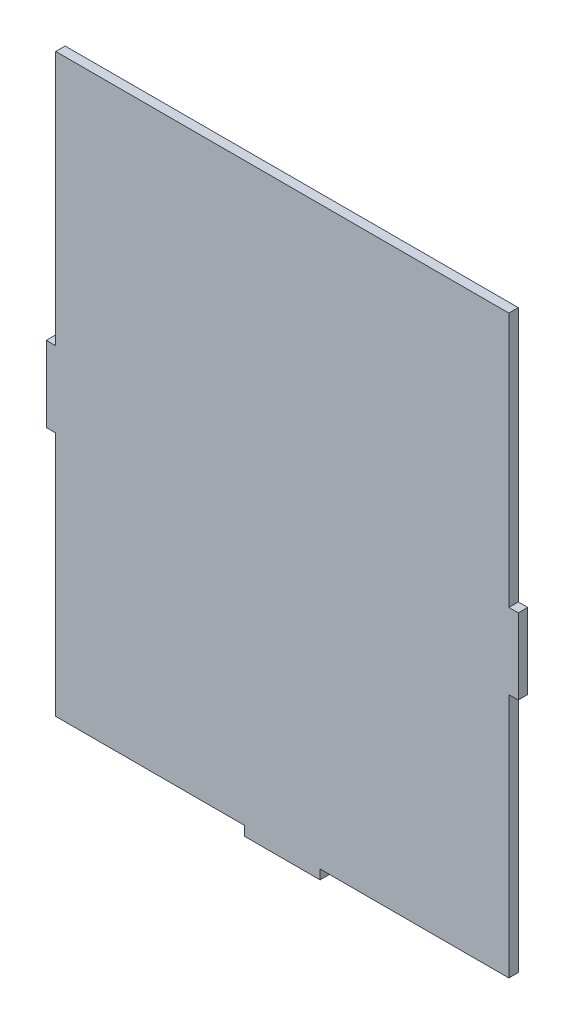
ISO-10303-21;
HEADER;
FILE_DESCRIPTION(('STEP AP214'),'2;1');
FILE_NAME('part.step','',(''),(''),'','','');
FILE_SCHEMA(('AUTOMOTIVE_DESIGN { 1 0 10303 214 1 1 1 1 }'));
ENDSEC;
DATA;
#1=APPLICATION_CONTEXT('core data for automotive mechanical design processes');
#2=APPLICATION_PROTOCOL_DEFINITION('international standard','automotive_design',2000,#1);
#3=PRODUCT_CONTEXT('',#1,'mechanical');
#4=PRODUCT('Part','Part','',(#3));
#5=PRODUCT_RELATED_PRODUCT_CATEGORY('part','',(#4));
#6=PRODUCT_DEFINITION_FORMATION('','',#4);
#7=PRODUCT_DEFINITION_CONTEXT('part definition',#1,'design');
#8=PRODUCT_DEFINITION('design','',#6,#7);
#9=PRODUCT_DEFINITION_SHAPE('','',#8);
#10=(LENGTH_UNIT() NAMED_UNIT(*) SI_UNIT(.MILLI.,.METRE.));
#11=(NAMED_UNIT(*) PLANE_ANGLE_UNIT() SI_UNIT($,.RADIAN.));
#12=(NAMED_UNIT(*) SI_UNIT($,.STERADIAN.) SOLID_ANGLE_UNIT());
#13=UNCERTAINTY_MEASURE_WITH_UNIT(LENGTH_MEASURE(1.E-05),#10,'distance_accuracy_value','');
#14=(GEOMETRIC_REPRESENTATION_CONTEXT(3) GLOBAL_UNCERTAINTY_ASSIGNED_CONTEXT((#13)) GLOBAL_UNIT_ASSIGNED_CONTEXT((#10,
#11,#12)) REPRESENTATION_CONTEXT('',''));
#15=CARTESIAN_POINT('',(0.,0.,0.));
#16=DIRECTION('',(0.,0.,1.));
#17=DIRECTION('',(1.,0.,0.));
#18=AXIS2_PLACEMENT_3D('',#15,#16,#17);
#19=CARTESIAN_POINT('',(5.,-290.,5.));
#20=DIRECTION('',(0.,1.,0.));
#21=DIRECTION('',(0.,0.,1.));
#22=AXIS2_PLACEMENT_3D('',#19,#20,#21);
#23=PLANE('',#22);
#24=DIRECTION('',(1.,0.,0.));
#25=VECTOR('',#24,1.);
#26=CARTESIAN_POINT('',(5.,-290.,0.));
#27=LINE('',#26,#25);
#28=CARTESIAN_POINT('',(5.,-290.,0.));
#29=VERTEX_POINT('',#28);
#30=CARTESIAN_POINT('',(105.,-290.,0.));
#31=VERTEX_POINT('',#30);
#32=EDGE_CURVE('E177',#29,#31,#27,.T.);
#33=ORIENTED_EDGE('',*,*,#32,.T.);
#34=DIRECTION('',(0.,0.,-1.));
#35=VECTOR('',#34,1.);
#36=CARTESIAN_POINT('',(105.,-290.,5.));
#37=LINE('',#36,#35);
#38=CARTESIAN_POINT('',(105.,-290.,5.));
#39=VERTEX_POINT('',#38);
#40=EDGE_CURVE('E11',#39,#31,#37,.T.);
#41=ORIENTED_EDGE('',*,*,#40,.F.);
#42=DIRECTION('',(1.,0.,0.));
#43=VECTOR('',#42,1.);
#44=CARTESIAN_POINT('',(5.,-290.,5.));
#45=LINE('',#44,#43);
#46=CARTESIAN_POINT('',(5.,-290.,5.));
#47=VERTEX_POINT('',#46);
#48=EDGE_CURVE('E207',#47,#39,#45,.T.);
#49=ORIENTED_EDGE('',*,*,#48,.F.);
#50=DIRECTION('',(0.,0.,-1.));
#51=VECTOR('',#50,1.);
#52=CARTESIAN_POINT('',(5.,-290.,5.));
#53=LINE('',#52,#51);
#54=EDGE_CURVE('E173',#47,#29,#53,.T.);
#55=ORIENTED_EDGE('',*,*,#54,.T.);
#56=EDGE_LOOP('',(#33,#41,#49,#55));
#57=FACE_BOUND('',#56,.T.);
#58=ADVANCED_FACE('F33',(#57),#23,.F.);
#59=CARTESIAN_POINT('',(105.,-290.,5.));
#60=DIRECTION('',(1.,0.,0.));
#61=DIRECTION('',(0.,0.,-1.));
#62=AXIS2_PLACEMENT_3D('',#59,#60,#61);
#63=PLANE('',#62);
#64=DIRECTION('',(0.,-1.,0.));
#65=VECTOR('',#64,1.);
#66=CARTESIAN_POINT('',(105.,-290.,0.));
#67=LINE('',#66,#65);
#68=CARTESIAN_POINT('',(105.,-295.,0.));
#69=VERTEX_POINT('',#68);
#70=EDGE_CURVE('E180',#31,#69,#67,.T.);
#71=ORIENTED_EDGE('',*,*,#70,.T.);
#72=DIRECTION('',(0.,0.,-1.));
#73=VECTOR('',#72,1.);
#74=CARTESIAN_POINT('',(105.,-295.,5.));
#75=LINE('',#74,#73);
#76=CARTESIAN_POINT('',(105.,-295.,5.));
#77=VERTEX_POINT('',#76);
#78=EDGE_CURVE('E41',#77,#69,#75,.T.);
#79=ORIENTED_EDGE('',*,*,#78,.F.);
#80=DIRECTION('',(0.,-1.,0.));
#81=VECTOR('',#80,1.);
#82=CARTESIAN_POINT('',(105.,-290.,5.));
#83=LINE('',#82,#81);
#84=EDGE_CURVE('E116',#39,#77,#83,.T.);
#85=ORIENTED_EDGE('',*,*,#84,.F.);
#86=ORIENTED_EDGE('',*,*,#40,.T.);
#87=EDGE_LOOP('',(#71,#79,#85,#86));
#88=FACE_BOUND('',#87,.T.);
#89=ADVANCED_FACE('F305',(#88),#63,.F.);
#90=CARTESIAN_POINT('',(105.,-295.,5.));
#91=DIRECTION('',(0.,1.,0.));
#92=DIRECTION('',(0.,0.,1.));
#93=AXIS2_PLACEMENT_3D('',#90,#91,#92);
#94=PLANE('',#93);
#95=DIRECTION('',(1.,0.,0.));
#96=VECTOR('',#95,1.);
#97=CARTESIAN_POINT('',(105.,-295.,0.));
#98=LINE('',#97,#96);
#99=CARTESIAN_POINT('',(145.,-295.,0.));
#100=VERTEX_POINT('',#99);
#101=EDGE_CURVE('E182',#69,#100,#98,.T.);
#102=ORIENTED_EDGE('',*,*,#101,.T.);
#103=DIRECTION('',(0.,0.,-1.));
#104=VECTOR('',#103,1.);
#105=CARTESIAN_POINT('',(145.,-295.,5.));
#106=LINE('',#105,#104);
#107=CARTESIAN_POINT('',(145.,-295.,5.));
#108=VERTEX_POINT('',#107);
#109=EDGE_CURVE('E238',#108,#100,#106,.T.);
#110=ORIENTED_EDGE('',*,*,#109,.F.);
#111=DIRECTION('',(1.,0.,0.));
#112=VECTOR('',#111,1.);
#113=CARTESIAN_POINT('',(105.,-295.,5.));
#114=LINE('',#113,#112);
#115=EDGE_CURVE('E246',#77,#108,#114,.T.);
#116=ORIENTED_EDGE('',*,*,#115,.F.);
#117=ORIENTED_EDGE('',*,*,#78,.T.);
#118=EDGE_LOOP('',(#102,#110,#116,#117));
#119=FACE_BOUND('',#118,.T.);
#120=ADVANCED_FACE('F244',(#119),#94,.F.);
#121=CARTESIAN_POINT('',(145.,-290.,5.));
#122=DIRECTION('',(-1.,0.,0.));
#123=DIRECTION('',(0.,0.,1.));
#124=AXIS2_PLACEMENT_3D('',#121,#122,#123);
#125=PLANE('',#124);
#126=DIRECTION('',(0.,1.,0.));
#127=VECTOR('',#126,1.);
#128=CARTESIAN_POINT('',(145.,-290.,0.));
#129=LINE('',#128,#127);
#130=CARTESIAN_POINT('',(145.,-290.,0.));
#131=VERTEX_POINT('',#130);
#132=EDGE_CURVE('E184',#100,#131,#129,.T.);
#133=ORIENTED_EDGE('',*,*,#132,.T.);
#134=DIRECTION('',(0.,0.,-1.));
#135=VECTOR('',#134,1.);
#136=CARTESIAN_POINT('',(145.,-290.,5.));
#137=LINE('',#136,#135);
#138=CARTESIAN_POINT('',(145.,-290.,5.));
#139=VERTEX_POINT('',#138);
#140=EDGE_CURVE('E235',#139,#131,#137,.T.);
#141=ORIENTED_EDGE('',*,*,#140,.F.);
#142=DIRECTION('',(0.,1.,0.));
#143=VECTOR('',#142,1.);
#144=CARTESIAN_POINT('',(145.,-290.,5.));
#145=LINE('',#144,#143);
#146=EDGE_CURVE('E264',#108,#139,#145,.T.);
#147=ORIENTED_EDGE('',*,*,#146,.F.);
#148=ORIENTED_EDGE('',*,*,#109,.T.);
#149=EDGE_LOOP('',(#133,#141,#147,#148));
#150=FACE_BOUND('',#149,.T.);
#151=ADVANCED_FACE('F255',(#150),#125,.F.);
#152=CARTESIAN_POINT('',(145.,-290.,5.));
#153=DIRECTION('',(0.,1.,0.));
#154=DIRECTION('',(0.,0.,1.));
#155=AXIS2_PLACEMENT_3D('',#152,#153,#154);
#156=PLANE('',#155);
#157=DIRECTION('',(1.,0.,0.));
#158=VECTOR('',#157,1.);
#159=CARTESIAN_POINT('',(145.,-290.,0.));
#160=LINE('',#159,#158);
#161=CARTESIAN_POINT('',(245.,-290.,0.));
#162=VERTEX_POINT('',#161);
#163=EDGE_CURVE('E186',#131,#162,#160,.T.);
#164=ORIENTED_EDGE('',*,*,#163,.T.);
#165=DIRECTION('',(0.,0.,-1.));
#166=VECTOR('',#165,1.);
#167=CARTESIAN_POINT('',(245.,-290.,5.));
#168=LINE('',#167,#166);
#169=CARTESIAN_POINT('',(245.,-290.,5.));
#170=VERTEX_POINT('',#169);
#171=EDGE_CURVE('E232',#170,#162,#168,.T.);
#172=ORIENTED_EDGE('',*,*,#171,.F.);
#173=DIRECTION('',(1.,0.,0.));
#174=VECTOR('',#173,1.);
#175=CARTESIAN_POINT('',(145.,-290.,5.));
#176=LINE('',#175,#174);
#177=EDGE_CURVE('E261',#139,#170,#176,.T.);
#178=ORIENTED_EDGE('',*,*,#177,.F.);
#179=ORIENTED_EDGE('',*,*,#140,.T.);
#180=EDGE_LOOP('',(#164,#172,#178,#179));
#181=FACE_BOUND('',#180,.T.);
#182=ADVANCED_FACE('F259',(#181),#156,.F.);
#183=CARTESIAN_POINT('',(245.,-160.,5.));
#184=DIRECTION('',(-1.,0.,0.));
#185=DIRECTION('',(0.,0.,1.));
#186=AXIS2_PLACEMENT_3D('',#183,#184,#185);
#187=PLANE('',#186);
#188=DIRECTION('',(0.,1.,0.));
#189=VECTOR('',#188,1.);
#190=CARTESIAN_POINT('',(245.,-160.,0.));
#191=LINE('',#190,#189);
#192=CARTESIAN_POINT('',(245.,-160.,0.));
#193=VERTEX_POINT('',#192);
#194=EDGE_CURVE('E188',#162,#193,#191,.T.);
#195=ORIENTED_EDGE('',*,*,#194,.T.);
#196=DIRECTION('',(0.,0.,-1.));
#197=VECTOR('',#196,1.);
#198=CARTESIAN_POINT('',(245.,-160.,5.));
#199=LINE('',#198,#197);
#200=CARTESIAN_POINT('',(245.,-160.,5.));
#201=VERTEX_POINT('',#200);
#202=EDGE_CURVE('E229',#201,#193,#199,.T.);
#203=ORIENTED_EDGE('',*,*,#202,.F.);
#204=DIRECTION('',(0.,1.,0.));
#205=VECTOR('',#204,1.);
#206=CARTESIAN_POINT('',(245.,-160.,5.));
#207=LINE('',#206,#205);
#208=EDGE_CURVE('E263',#170,#201,#207,.T.);
#209=ORIENTED_EDGE('',*,*,#208,.F.);
#210=ORIENTED_EDGE('',*,*,#171,.T.);
#211=EDGE_LOOP('',(#195,#203,#209,#210));
#212=FACE_BOUND('',#211,.T.);
#213=ADVANCED_FACE('F318',(#212),#187,.F.);
#214=CARTESIAN_POINT('',(250.,-160.,5.));
#215=DIRECTION('',(0.,1.,0.));
#216=DIRECTION('',(0.,0.,1.));
#217=AXIS2_PLACEMENT_3D('',#214,#215,#216);
#218=PLANE('',#217);
#219=DIRECTION('',(1.,0.,0.));
#220=VECTOR('',#219,1.);
#221=CARTESIAN_POINT('',(250.,-160.,0.));
#222=LINE('',#221,#220);
#223=CARTESIAN_POINT('',(250.,-160.,0.));
#224=VERTEX_POINT('',#223);
#225=EDGE_CURVE('E190',#193,#224,#222,.T.);
#226=ORIENTED_EDGE('',*,*,#225,.T.);
#227=DIRECTION('',(0.,0.,-1.));
#228=VECTOR('',#227,1.);
#229=CARTESIAN_POINT('',(250.,-160.,5.));
#230=LINE('',#229,#228);
#231=CARTESIAN_POINT('',(250.,-160.,5.));
#232=VERTEX_POINT('',#231);
#233=EDGE_CURVE('E226',#232,#224,#230,.T.);
#234=ORIENTED_EDGE('',*,*,#233,.F.);
#235=DIRECTION('',(1.,0.,0.));
#236=VECTOR('',#235,1.);
#237=CARTESIAN_POINT('',(250.,-160.,5.));
#238=LINE('',#237,#236);
#239=EDGE_CURVE('E266',#201,#232,#238,.T.);
#240=ORIENTED_EDGE('',*,*,#239,.F.);
#241=ORIENTED_EDGE('',*,*,#202,.T.);
#242=EDGE_LOOP('',(#226,#234,#240,#241));
#243=FACE_BOUND('',#242,.T.);
#244=ADVANCED_FACE('F321',(#243),#218,.F.);
#245=CARTESIAN_POINT('',(250.,-120.,5.));
#246=DIRECTION('',(-1.,0.,0.));
#247=DIRECTION('',(0.,0.,1.));
#248=AXIS2_PLACEMENT_3D('',#245,#246,#247);
#249=PLANE('',#248);
#250=DIRECTION('',(0.,1.,0.));
#251=VECTOR('',#250,1.);
#252=CARTESIAN_POINT('',(250.,-120.,0.));
#253=LINE('',#252,#251);
#254=CARTESIAN_POINT('',(250.,-120.,0.));
#255=VERTEX_POINT('',#254);
#256=EDGE_CURVE('E192',#224,#255,#253,.T.);
#257=ORIENTED_EDGE('',*,*,#256,.T.);
#258=DIRECTION('',(0.,0.,-1.));
#259=VECTOR('',#258,1.);
#260=CARTESIAN_POINT('',(250.,-120.,5.));
#261=LINE('',#260,#259);
#262=CARTESIAN_POINT('',(250.,-120.,5.));
#263=VERTEX_POINT('',#262);
#264=EDGE_CURVE('E223',#263,#255,#261,.T.);
#265=ORIENTED_EDGE('',*,*,#264,.F.);
#266=DIRECTION('',(0.,1.,0.));
#267=VECTOR('',#266,1.);
#268=CARTESIAN_POINT('',(250.,-120.,5.));
#269=LINE('',#268,#267);
#270=EDGE_CURVE('E272',#232,#263,#269,.T.);
#271=ORIENTED_EDGE('',*,*,#270,.F.);
#272=ORIENTED_EDGE('',*,*,#233,.T.);
#273=EDGE_LOOP('',(#257,#265,#271,#272));
#274=FACE_BOUND('',#273,.T.);
#275=ADVANCED_FACE('F325',(#274),#249,.F.);
#276=CARTESIAN_POINT('',(245.,-120.,5.));
#277=DIRECTION('',(0.,-1.,0.));
#278=DIRECTION('',(0.,0.,-1.));
#279=AXIS2_PLACEMENT_3D('',#276,#277,#278);
#280=PLANE('',#279);
#281=DIRECTION('',(-1.,0.,0.));
#282=VECTOR('',#281,1.);
#283=CARTESIAN_POINT('',(245.,-120.,0.));
#284=LINE('',#283,#282);
#285=CARTESIAN_POINT('',(245.,-120.,0.));
#286=VERTEX_POINT('',#285);
#287=EDGE_CURVE('E194',#255,#286,#284,.T.);
#288=ORIENTED_EDGE('',*,*,#287,.T.);
#289=DIRECTION('',(0.,0.,-1.));
#290=VECTOR('',#289,1.);
#291=CARTESIAN_POINT('',(245.,-120.,5.));
#292=LINE('',#291,#290);
#293=CARTESIAN_POINT('',(245.,-120.,5.));
#294=VERTEX_POINT('',#293);
#295=EDGE_CURVE('E220',#294,#286,#292,.T.);
#296=ORIENTED_EDGE('',*,*,#295,.F.);
#297=DIRECTION('',(-1.,0.,0.));
#298=VECTOR('',#297,1.);
#299=CARTESIAN_POINT('',(245.,-120.,5.));
#300=LINE('',#299,#298);
#301=EDGE_CURVE('E274',#263,#294,#300,.T.);
#302=ORIENTED_EDGE('',*,*,#301,.F.);
#303=ORIENTED_EDGE('',*,*,#264,.T.);
#304=EDGE_LOOP('',(#288,#296,#302,#303));
#305=FACE_BOUND('',#304,.T.);
#306=ADVANCED_FACE('F329',(#305),#280,.F.);
#307=CARTESIAN_POINT('',(245.,15.,5.));
#308=DIRECTION('',(-1.,0.,0.));
#309=DIRECTION('',(0.,0.,1.));
#310=AXIS2_PLACEMENT_3D('',#307,#308,#309);
#311=PLANE('',#310);
#312=DIRECTION('',(0.,1.,0.));
#313=VECTOR('',#312,1.);
#314=CARTESIAN_POINT('',(245.,15.,0.));
#315=LINE('',#314,#313);
#316=CARTESIAN_POINT('',(245.,15.,0.));
#317=VERTEX_POINT('',#316);
#318=EDGE_CURVE('E196',#286,#317,#315,.T.);
#319=ORIENTED_EDGE('',*,*,#318,.T.);
#320=DIRECTION('',(0.,0.,-1.));
#321=VECTOR('',#320,1.);
#322=CARTESIAN_POINT('',(245.,15.,5.));
#323=LINE('',#322,#321);
#324=CARTESIAN_POINT('',(245.,15.,5.));
#325=VERTEX_POINT('',#324);
#326=EDGE_CURVE('E217',#325,#317,#323,.T.);
#327=ORIENTED_EDGE('',*,*,#326,.F.);
#328=DIRECTION('',(0.,1.,0.));
#329=VECTOR('',#328,1.);
#330=CARTESIAN_POINT('',(245.,15.,5.));
#331=LINE('',#330,#329);
#332=EDGE_CURVE('E276',#294,#325,#331,.T.);
#333=ORIENTED_EDGE('',*,*,#332,.F.);
#334=ORIENTED_EDGE('',*,*,#295,.T.);
#335=EDGE_LOOP('',(#319,#327,#333,#334));
#336=FACE_BOUND('',#335,.T.);
#337=ADVANCED_FACE('F333',(#336),#311,.F.);
#338=CARTESIAN_POINT('',(5.,15.,5.));
#339=DIRECTION('',(0.,-1.,0.));
#340=DIRECTION('',(0.,0.,-1.));
#341=AXIS2_PLACEMENT_3D('',#338,#339,#340);
#342=PLANE('',#341);
#343=DIRECTION('',(-1.,0.,0.));
#344=VECTOR('',#343,1.);
#345=CARTESIAN_POINT('',(5.,15.,0.));
#346=LINE('',#345,#344);
#347=CARTESIAN_POINT('',(5.,15.,0.));
#348=VERTEX_POINT('',#347);
#349=EDGE_CURVE('E198',#317,#348,#346,.T.);
#350=ORIENTED_EDGE('',*,*,#349,.T.);
#351=DIRECTION('',(0.,0.,-1.));
#352=VECTOR('',#351,1.);
#353=CARTESIAN_POINT('',(5.,15.,5.));
#354=LINE('',#353,#352);
#355=CARTESIAN_POINT('',(5.,15.,5.));
#356=VERTEX_POINT('',#355);
#357=EDGE_CURVE('E214',#356,#348,#354,.T.);
#358=ORIENTED_EDGE('',*,*,#357,.F.);
#359=DIRECTION('',(-1.,0.,0.));
#360=VECTOR('',#359,1.);
#361=CARTESIAN_POINT('',(5.,15.,5.));
#362=LINE('',#361,#360);
#363=EDGE_CURVE('E278',#325,#356,#362,.T.);
#364=ORIENTED_EDGE('',*,*,#363,.F.);
#365=ORIENTED_EDGE('',*,*,#326,.T.);
#366=EDGE_LOOP('',(#350,#358,#364,#365));
#367=FACE_BOUND('',#366,.T.);
#368=ADVANCED_FACE('F337',(#367),#342,.F.);
#369=CARTESIAN_POINT('',(5.,15.,5.));
#370=DIRECTION('',(1.,0.,0.));
#371=DIRECTION('',(0.,0.,-1.));
#372=AXIS2_PLACEMENT_3D('',#369,#370,#371);
#373=PLANE('',#372);
#374=DIRECTION('',(0.,-1.,0.));
#375=VECTOR('',#374,1.);
#376=CARTESIAN_POINT('',(5.,15.,0.));
#377=LINE('',#376,#375);
#378=CARTESIAN_POINT('',(5.,-120.,0.));
#379=VERTEX_POINT('',#378);
#380=EDGE_CURVE('E200',#348,#379,#377,.T.);
#381=ORIENTED_EDGE('',*,*,#380,.T.);
#382=DIRECTION('',(0.,0.,-1.));
#383=VECTOR('',#382,1.);
#384=CARTESIAN_POINT('',(5.,-120.,5.));
#385=LINE('',#384,#383);
#386=CARTESIAN_POINT('',(5.,-120.,5.));
#387=VERTEX_POINT('',#386);
#388=EDGE_CURVE('E211',#387,#379,#385,.T.);
#389=ORIENTED_EDGE('',*,*,#388,.F.);
#390=DIRECTION('',(0.,-1.,0.));
#391=VECTOR('',#390,1.);
#392=CARTESIAN_POINT('',(5.,15.,5.));
#393=LINE('',#392,#391);
#394=EDGE_CURVE('E280',#356,#387,#393,.T.);
#395=ORIENTED_EDGE('',*,*,#394,.F.);
#396=ORIENTED_EDGE('',*,*,#357,.T.);
#397=EDGE_LOOP('',(#381,#389,#395,#396));
#398=FACE_BOUND('',#397,.T.);
#399=ADVANCED_FACE('F286',(#398),#373,.F.);
#400=CARTESIAN_POINT('',(5.,-120.,5.));
#401=DIRECTION('',(0.,-1.,0.));
#402=DIRECTION('',(0.,0.,-1.));
#403=AXIS2_PLACEMENT_3D('',#400,#401,#402);
#404=PLANE('',#403);
#405=DIRECTION('',(-1.,0.,0.));
#406=VECTOR('',#405,1.);
#407=CARTESIAN_POINT('',(5.,-120.,0.));
#408=LINE('',#407,#406);
#409=CARTESIAN_POINT('',(0.,-120.,0.));
#410=VERTEX_POINT('',#409);
#411=EDGE_CURVE('E202',#379,#410,#408,.T.);
#412=ORIENTED_EDGE('',*,*,#411,.T.);
#413=DIRECTION('',(0.,0.,-1.));
#414=VECTOR('',#413,1.);
#415=CARTESIAN_POINT('',(0.,-120.,5.));
#416=LINE('',#415,#414);
#417=CARTESIAN_POINT('',(0.,-120.,5.));
#418=VERTEX_POINT('',#417);
#419=EDGE_CURVE('E168',#418,#410,#416,.T.);
#420=ORIENTED_EDGE('',*,*,#419,.F.);
#421=DIRECTION('',(-1.,0.,0.));
#422=VECTOR('',#421,1.);
#423=CARTESIAN_POINT('',(5.,-120.,5.));
#424=LINE('',#423,#422);
#425=EDGE_CURVE('E159',#387,#418,#424,.T.);
#426=ORIENTED_EDGE('',*,*,#425,.F.);
#427=ORIENTED_EDGE('',*,*,#388,.T.);
#428=EDGE_LOOP('',(#412,#420,#426,#427));
#429=FACE_BOUND('',#428,.T.);
#430=ADVANCED_FACE('F290',(#429),#404,.F.);
#431=CARTESIAN_POINT('',(0.,-120.,5.));
#432=DIRECTION('',(1.,0.,0.));
#433=DIRECTION('',(0.,0.,-1.));
#434=AXIS2_PLACEMENT_3D('',#431,#432,#433);
#435=PLANE('',#434);
#436=DIRECTION('',(0.,-1.,0.));
#437=VECTOR('',#436,1.);
#438=CARTESIAN_POINT('',(0.,-120.,0.));
#439=LINE('',#438,#437);
#440=CARTESIAN_POINT('',(0.,-160.,0.));
#441=VERTEX_POINT('',#440);
#442=EDGE_CURVE('E167',#410,#441,#439,.T.);
#443=ORIENTED_EDGE('',*,*,#442,.T.);
#444=DIRECTION('',(0.,0.,-1.));
#445=VECTOR('',#444,1.);
#446=CARTESIAN_POINT('',(0.,-160.,5.));
#447=LINE('',#446,#445);
#448=CARTESIAN_POINT('',(0.,-160.,5.));
#449=VERTEX_POINT('',#448);
#450=EDGE_CURVE('E164',#449,#441,#447,.T.);
#451=ORIENTED_EDGE('',*,*,#450,.F.);
#452=DIRECTION('',(0.,-1.,0.));
#453=VECTOR('',#452,1.);
#454=CARTESIAN_POINT('',(0.,-120.,5.));
#455=LINE('',#454,#453);
#456=EDGE_CURVE('E153',#418,#449,#455,.T.);
#457=ORIENTED_EDGE('',*,*,#456,.F.);
#458=ORIENTED_EDGE('',*,*,#419,.T.);
#459=EDGE_LOOP('',(#443,#451,#457,#458));
#460=FACE_BOUND('',#459,.T.);
#461=ADVANCED_FACE('F165',(#460),#435,.F.);
#462=CARTESIAN_POINT('',(0.,-160.,5.));
#463=DIRECTION('',(0.,1.,0.));
#464=DIRECTION('',(0.,0.,1.));
#465=AXIS2_PLACEMENT_3D('',#462,#463,#464);
#466=PLANE('',#465);
#467=DIRECTION('',(1.,0.,0.));
#468=VECTOR('',#467,1.);
#469=CARTESIAN_POINT('',(0.,-160.,0.));
#470=LINE('',#469,#468);
#471=CARTESIAN_POINT('',(5.,-160.,0.));
#472=VERTEX_POINT('',#471);
#473=EDGE_CURVE('E102',#441,#472,#470,.T.);
#474=ORIENTED_EDGE('',*,*,#473,.T.);
#475=DIRECTION('',(0.,0.,-1.));
#476=VECTOR('',#475,1.);
#477=CARTESIAN_POINT('',(5.,-160.,5.));
#478=LINE('',#477,#476);
#479=CARTESIAN_POINT('',(5.,-160.,5.));
#480=VERTEX_POINT('',#479);
#481=EDGE_CURVE('E169',#480,#472,#478,.T.);
#482=ORIENTED_EDGE('',*,*,#481,.F.);
#483=DIRECTION('',(1.,0.,0.));
#484=VECTOR('',#483,1.);
#485=CARTESIAN_POINT('',(0.,-160.,5.));
#486=LINE('',#485,#484);
#487=EDGE_CURVE('E157',#449,#480,#486,.T.);
#488=ORIENTED_EDGE('',*,*,#487,.F.);
#489=ORIENTED_EDGE('',*,*,#450,.T.);
#490=EDGE_LOOP('',(#474,#482,#488,#489));
#491=FACE_BOUND('',#490,.T.);
#492=ADVANCED_FACE('F171',(#491),#466,.F.);
#493=CARTESIAN_POINT('',(5.,-160.,5.));
#494=DIRECTION('',(1.,0.,0.));
#495=DIRECTION('',(0.,0.,-1.));
#496=AXIS2_PLACEMENT_3D('',#493,#494,#495);
#497=PLANE('',#496);
#498=DIRECTION('',(0.,-1.,0.));
#499=VECTOR('',#498,1.);
#500=CARTESIAN_POINT('',(5.,-160.,0.));
#501=LINE('',#500,#499);
#502=EDGE_CURVE('E108',#472,#29,#501,.T.);
#503=ORIENTED_EDGE('',*,*,#502,.T.);
#504=ORIENTED_EDGE('',*,*,#54,.F.);
#505=DIRECTION('',(0.,-1.,0.));
#506=VECTOR('',#505,1.);
#507=CARTESIAN_POINT('',(5.,-160.,5.));
#508=LINE('',#507,#506);
#509=EDGE_CURVE('E49',#480,#47,#508,.T.);
#510=ORIENTED_EDGE('',*,*,#509,.F.);
#511=ORIENTED_EDGE('',*,*,#481,.T.);
#512=EDGE_LOOP('',(#503,#504,#510,#511));
#513=FACE_BOUND('',#512,.T.);
#514=ADVANCED_FACE('F294',(#513),#497,.F.);
#515=CARTESIAN_POINT('',(0.,0.,5.));
#516=DIRECTION('',(0.,0.,-1.));
#517=DIRECTION('',(-1.,0.,0.));
#518=AXIS2_PLACEMENT_3D('',#515,#516,#517);
#519=PLANE('',#518);
#520=ORIENTED_EDGE('',*,*,#48,.T.);
#521=ORIENTED_EDGE('',*,*,#84,.T.);
#522=ORIENTED_EDGE('',*,*,#115,.T.);
#523=ORIENTED_EDGE('',*,*,#146,.T.);
#524=ORIENTED_EDGE('',*,*,#177,.T.);
#525=ORIENTED_EDGE('',*,*,#208,.T.);
#526=ORIENTED_EDGE('',*,*,#239,.T.);
#527=ORIENTED_EDGE('',*,*,#270,.T.);
#528=ORIENTED_EDGE('',*,*,#301,.T.);
#529=ORIENTED_EDGE('',*,*,#332,.T.);
#530=ORIENTED_EDGE('',*,*,#363,.T.);
#531=ORIENTED_EDGE('',*,*,#394,.T.);
#532=ORIENTED_EDGE('',*,*,#425,.T.);
#533=ORIENTED_EDGE('',*,*,#456,.T.);
#534=ORIENTED_EDGE('',*,*,#487,.T.);
#535=ORIENTED_EDGE('',*,*,#509,.T.);
#536=EDGE_LOOP('',(#520,#521,#522,#523,#524,#525,#526,#527,#528,#529,#530,#531,#532,#533,#534,#535));
#537=FACE_BOUND('',#536,.T.);
#538=ADVANCED_FACE('F155',(#537),#519,.F.);
#539=CARTESIAN_POINT('',(0.,0.,0.));
#540=DIRECTION('',(0.,0.,-1.));
#541=DIRECTION('',(-1.,0.,0.));
#542=AXIS2_PLACEMENT_3D('',#539,#540,#541);
#543=PLANE('',#542);
#544=ORIENTED_EDGE('',*,*,#32,.F.);
#545=ORIENTED_EDGE('',*,*,#502,.F.);
#546=ORIENTED_EDGE('',*,*,#473,.F.);
#547=ORIENTED_EDGE('',*,*,#442,.F.);
#548=ORIENTED_EDGE('',*,*,#411,.F.);
#549=ORIENTED_EDGE('',*,*,#380,.F.);
#550=ORIENTED_EDGE('',*,*,#349,.F.);
#551=ORIENTED_EDGE('',*,*,#318,.F.);
#552=ORIENTED_EDGE('',*,*,#287,.F.);
#553=ORIENTED_EDGE('',*,*,#256,.F.);
#554=ORIENTED_EDGE('',*,*,#225,.F.);
#555=ORIENTED_EDGE('',*,*,#194,.F.);
#556=ORIENTED_EDGE('',*,*,#163,.F.);
#557=ORIENTED_EDGE('',*,*,#132,.F.);
#558=ORIENTED_EDGE('',*,*,#101,.F.);
#559=ORIENTED_EDGE('',*,*,#70,.F.);
#560=EDGE_LOOP('',(#544,#545,#546,#547,#548,#549,#550,#551,#552,#553,#554,#555,#556,#557,#558,#559));
#561=FACE_BOUND('',#560,.T.);
#562=ADVANCED_FACE('F250',(#561),#543,.T.);
#563=CLOSED_SHELL('',(#58,#89,#120,#151,#182,#213,#244,#275,#306,#337,#368,#399,#430,#461,#492,
#514,#538,#562));
#564=MANIFOLD_SOLID_BREP('B2',#563);
#565=ADVANCED_BREP_SHAPE_REPRESENTATION('',(#18,#564),#14);
#566=SHAPE_DEFINITION_REPRESENTATION(#9,#565);
ENDSEC;
END-ISO-10303-21;
